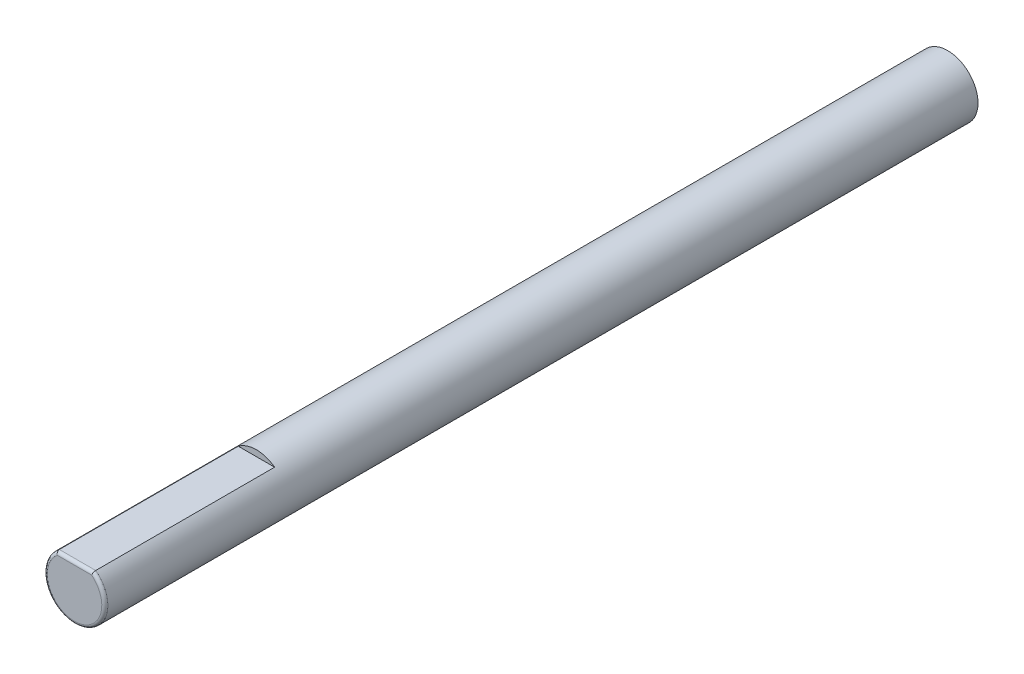
ISO-10303-21;
HEADER;
FILE_DESCRIPTION(('STEP AP214'),'2;1');
FILE_NAME('part.step','',(''),(''),'','','');
FILE_SCHEMA(('AUTOMOTIVE_DESIGN { 1 0 10303 214 1 1 1 1 }'));
ENDSEC;
DATA;
#1=APPLICATION_CONTEXT('core data for automotive mechanical design processes');
#2=APPLICATION_PROTOCOL_DEFINITION('international standard','automotive_design',2000,#1);
#3=PRODUCT_CONTEXT('',#1,'mechanical');
#4=PRODUCT('Part','Part','',(#3));
#5=PRODUCT_RELATED_PRODUCT_CATEGORY('part','',(#4));
#6=PRODUCT_DEFINITION_FORMATION('','',#4);
#7=PRODUCT_DEFINITION_CONTEXT('part definition',#1,'design');
#8=PRODUCT_DEFINITION('design','',#6,#7);
#9=PRODUCT_DEFINITION_SHAPE('','',#8);
#10=(LENGTH_UNIT() NAMED_UNIT(*) SI_UNIT(.MILLI.,.METRE.));
#11=(NAMED_UNIT(*) PLANE_ANGLE_UNIT() SI_UNIT($,.RADIAN.));
#12=(NAMED_UNIT(*) SI_UNIT($,.STERADIAN.) SOLID_ANGLE_UNIT());
#13=UNCERTAINTY_MEASURE_WITH_UNIT(LENGTH_MEASURE(1.E-05),#10,'distance_accuracy_value','');
#14=(GEOMETRIC_REPRESENTATION_CONTEXT(3) GLOBAL_UNCERTAINTY_ASSIGNED_CONTEXT((#13)) GLOBAL_UNIT_ASSIGNED_CONTEXT((#10,
#11,#12)) REPRESENTATION_CONTEXT('',''));
#15=CARTESIAN_POINT('',(0.,0.,0.));
#16=DIRECTION('',(0.,0.,1.));
#17=DIRECTION('',(1.,0.,0.));
#18=AXIS2_PLACEMENT_3D('',#15,#16,#17);
#19=CARTESIAN_POINT('',(0.,0.,36.));
#20=DIRECTION('',(0.,0.,-1.));
#21=DIRECTION('',(-1.,0.,0.));
#22=AXIS2_PLACEMENT_3D('',#19,#20,#21);
#23=CYLINDRICAL_SURFACE('',#22,2.5);
#24=DIRECTION('',(0.,0.,1.));
#25=VECTOR('',#24,1.);
#26=CARTESIAN_POINT('',(1.5,2.,21.));
#27=LINE('',#26,#25);
#28=CARTESIAN_POINT('',(1.5,2.,21.));
#29=VERTEX_POINT('',#28);
#30=CARTESIAN_POINT('',(1.5,2.,35.75));
#31=VERTEX_POINT('',#30);
#32=EDGE_CURVE('E83',#29,#31,#27,.T.);
#33=ORIENTED_EDGE('',*,*,#32,.T.);
#34=CARTESIAN_POINT('',(0.,0.,35.75));
#35=DIRECTION('',(0.,0.,1.));
#36=DIRECTION('',(1.,0.,0.));
#37=AXIS2_PLACEMENT_3D('',#34,#35,#36);
#38=CIRCLE('',#37,2.5);
#39=CARTESIAN_POINT('',(-1.5,2.,35.75));
#40=VERTEX_POINT('',#39);
#41=EDGE_CURVE('E47',#31,#40,#38,.F.);
#42=ORIENTED_EDGE('',*,*,#41,.T.);
#43=DIRECTION('',(0.,0.,1.));
#44=VECTOR('',#43,1.);
#45=CARTESIAN_POINT('',(-1.5,2.,21.));
#46=LINE('',#45,#44);
#47=CARTESIAN_POINT('',(-1.5,2.,21.));
#48=VERTEX_POINT('',#47);
#49=EDGE_CURVE('E82',#48,#40,#46,.T.);
#50=ORIENTED_EDGE('',*,*,#49,.F.);
#51=CARTESIAN_POINT('',(0.,0.,21.));
#52=DIRECTION('',(0.,0.,1.));
#53=DIRECTION('',(1.,0.,0.));
#54=AXIS2_PLACEMENT_3D('',#51,#52,#53);
#55=CIRCLE('',#54,2.5);
#56=EDGE_CURVE('E74',#29,#48,#55,.T.);
#57=ORIENTED_EDGE('',*,*,#56,.F.);
#58=EDGE_LOOP('',(#33,#42,#50,#57));
#59=FACE_BOUND('',#58,.T.);
#60=CARTESIAN_POINT('',(0.,0.,-36.));
#61=DIRECTION('',(0.,0.,1.));
#62=DIRECTION('',(1.,0.,0.));
#63=AXIS2_PLACEMENT_3D('',#60,#61,#62);
#64=CIRCLE('',#63,2.5);
#65=CARTESIAN_POINT('',(2.5,0.,-36.));
#66=VERTEX_POINT('',#65);
#67=EDGE_CURVE('E88',#66,#66,#64,.T.);
#68=ORIENTED_EDGE('',*,*,#67,.T.);
#69=EDGE_LOOP('',(#68));
#70=FACE_BOUND('',#69,.T.);
#71=ADVANCED_FACE('F33',(#59,#70),#23,.T.);
#72=CARTESIAN_POINT('',(0.,0.,36.));
#73=DIRECTION('',(0.,0.,1.));
#74=DIRECTION('',(1.,0.,0.));
#75=AXIS2_PLACEMENT_3D('',#72,#73,#74);
#76=PLANE('',#75);
#77=DIRECTION('',(1.,0.,0.));
#78=VECTOR('',#77,1.);
#79=CARTESIAN_POINT('',(-1.5,1.75,36.));
#80=LINE('',#79,#78);
#81=CARTESIAN_POINT('',(1.41421356237331,1.75,36.));
#82=VERTEX_POINT('',#81);
#83=CARTESIAN_POINT('',(-1.41421356237331,1.75,36.));
#84=VERTEX_POINT('',#83);
#85=EDGE_CURVE('E93',#82,#84,#80,.F.);
#86=ORIENTED_EDGE('',*,*,#85,.T.);
#87=CARTESIAN_POINT('',(0.,0.,36.));
#88=DIRECTION('',(0.,0.,1.));
#89=DIRECTION('',(1.,0.,0.));
#90=AXIS2_PLACEMENT_3D('',#87,#88,#89);
#91=CIRCLE('',#90,2.25);
#92=EDGE_CURVE('E95',#84,#82,#91,.T.);
#93=ORIENTED_EDGE('',*,*,#92,.T.);
#94=EDGE_LOOP('',(#86,#93));
#95=FACE_BOUND('',#94,.T.);
#96=ADVANCED_FACE('F110',(#95),#76,.T.);
#97=CARTESIAN_POINT('',(0.,0.,-36.));
#98=DIRECTION('',(0.,0.,1.));
#99=DIRECTION('',(1.,0.,0.));
#100=AXIS2_PLACEMENT_3D('',#97,#98,#99);
#101=PLANE('',#100);
#102=ORIENTED_EDGE('',*,*,#67,.F.);
#103=EDGE_LOOP('',(#102));
#104=FACE_BOUND('',#103,.T.);
#105=ADVANCED_FACE('F111',(#104),#101,.F.);
#106=CARTESIAN_POINT('',(-1.5,2.,21.));
#107=DIRECTION('',(0.,-1.,0.));
#108=DIRECTION('',(0.,0.,-1.));
#109=AXIS2_PLACEMENT_3D('',#106,#107,#108);
#110=PLANE('',#109);
#111=ORIENTED_EDGE('',*,*,#49,.T.);
#112=DIRECTION('',(1.,0.,0.));
#113=VECTOR('',#112,1.);
#114=CARTESIAN_POINT('',(1.5,2.,35.75));
#115=LINE('',#114,#113);
#116=EDGE_CURVE('E11',#40,#31,#115,.T.);
#117=ORIENTED_EDGE('',*,*,#116,.T.);
#118=ORIENTED_EDGE('',*,*,#32,.F.);
#119=DIRECTION('',(1.,0.,0.));
#120=VECTOR('',#119,1.);
#121=CARTESIAN_POINT('',(-1.5,2.,21.));
#122=LINE('',#121,#120);
#123=EDGE_CURVE('E77',#48,#29,#122,.T.);
#124=ORIENTED_EDGE('',*,*,#123,.F.);
#125=EDGE_LOOP('',(#111,#117,#118,#124));
#126=FACE_BOUND('',#125,.T.);
#127=ADVANCED_FACE('F81',(#126),#110,.F.);
#128=CARTESIAN_POINT('',(0.,0.,21.));
#129=DIRECTION('',(0.,0.,1.));
#130=DIRECTION('',(1.,0.,0.));
#131=AXIS2_PLACEMENT_3D('',#128,#129,#130);
#132=PLANE('',#131);
#133=ORIENTED_EDGE('',*,*,#56,.T.);
#134=ORIENTED_EDGE('',*,*,#123,.T.);
#135=EDGE_LOOP('',(#133,#134));
#136=FACE_BOUND('',#135,.T.);
#137=ADVANCED_FACE('F76',(#136),#132,.T.);
#138=CARTESIAN_POINT('',(-1.5,1.75,35.75));
#139=DIRECTION('',(-1.,0.,0.));
#140=DIRECTION('',(0.,0.,1.));
#141=AXIS2_PLACEMENT_3D('',#138,#139,#140);
#142=CYLINDRICAL_SURFACE('',#141,0.25);
#143=CARTESIAN_POINT('',(1.5,2.,35.75));
#144=CARTESIAN_POINT('',(1.50000417865665,2.00001412295188,35.7635362476095));
#145=CARTESIAN_POINT('',(1.49963384944121,1.99890156739159,35.7770649136864));
#146=CARTESIAN_POINT('',(1.49817646893611,1.99453178409593,35.803703499777));
#147=CARTESIAN_POINT('',(1.49709092730071,1.99127907377054,35.8168142409595));
#148=CARTESIAN_POINT('',(1.49423517680934,1.98273685679408,35.8422734630497));
#149=CARTESIAN_POINT('',(1.4924649704674,1.9774473576219,35.8546219467561));
#150=CARTESIAN_POINT('',(1.48829599124956,1.9650205975245,35.8782344653412));
#151=CARTESIAN_POINT('',(1.4858971171193,1.95788303894975,35.8894983251284));
#152=CARTESIAN_POINT('',(1.48048407646806,1.94182565292694,35.9108898233462));
#153=CARTESIAN_POINT('',(1.47745811354684,1.9328717380689,35.9209888424914));
#154=CARTESIAN_POINT('',(1.47090719118636,1.91355724701079,35.9395481990963));
#155=CARTESIAN_POINT('',(1.4673820594633,1.90319618519681,35.9480079683853));
#156=CARTESIAN_POINT('',(1.4597416584497,1.8808304290218,35.9634884539344));
#157=CARTESIAN_POINT('',(1.45560597515412,1.86877017347735,35.9704187042036));
#158=CARTESIAN_POINT('',(1.44699364632756,1.84377210784133,35.9821581165234));
#159=CARTESIAN_POINT('',(1.44251701551424,1.83083433563209,35.9869673700701));
#160=CARTESIAN_POINT('',(1.43429994960781,1.80720313950861,35.9936091690749));
#161=CARTESIAN_POINT('',(1.43060199205919,1.79660800814989,35.9958544493701));
#162=CARTESIAN_POINT('',(1.42312126586469,1.7752602081721,35.9989535542845));
#163=CARTESIAN_POINT('',(1.41933866039702,1.76450785453121,35.9998098556094));
#164=CARTESIAN_POINT('',(1.41509974133087,1.75250707809193,35.9999905927916));
#165=CARTESIAN_POINT('',(1.41465671804431,1.75125342894238,36.0000000237643));
#166=CARTESIAN_POINT('',(1.4142135623731,1.75,36.));
#167=B_SPLINE_CURVE_WITH_KNOTS('',3,(#143,#144,#145,#146,#147,#148,#149,#150,#151,#152,#153,
#154,#155,#156,#157,#158,#159,#160,#161,#162,#163,#164,#165,#166),.UNSPECIFIED.,.F.,.F.,(4,2,2,
2,2,2,2,2,2,2,2,4),(0.,0.0405464298652532,0.0810075482566391,0.121468518080043,0.16193600862905,
0.203248063107221,0.244574410996504,0.287919195499839,0.331262110001295,0.365515938591456,
0.39970862134593,0.403697443625867),.UNSPECIFIED.);
#168=EDGE_CURVE('E98',#31,#82,#167,.T.);
#169=ORIENTED_EDGE('',*,*,#168,.F.);
#170=ORIENTED_EDGE('',*,*,#116,.F.);
#171=CARTESIAN_POINT('',(-1.5,2.,35.75));
#172=CARTESIAN_POINT('',(-1.50000417865665,2.00001412295188,35.7635362476095));
#173=CARTESIAN_POINT('',(-1.49963384944121,1.99890156739159,35.7770649136864));
#174=CARTESIAN_POINT('',(-1.49817646893611,1.99453178409593,35.803703499777));
#175=CARTESIAN_POINT('',(-1.49709092730071,1.99127907377054,35.8168142409595));
#176=CARTESIAN_POINT('',(-1.49423517680934,1.98273685679408,35.8422734630497));
#177=CARTESIAN_POINT('',(-1.4924649704674,1.9774473576219,35.8546219467561));
#178=CARTESIAN_POINT('',(-1.48829599124956,1.9650205975245,35.8782344653412));
#179=CARTESIAN_POINT('',(-1.4858971171193,1.95788303894975,35.8894983251284));
#180=CARTESIAN_POINT('',(-1.48048407646806,1.94182565292694,35.9108898233462));
#181=CARTESIAN_POINT('',(-1.47745811354684,1.9328717380689,35.9209888424914));
#182=CARTESIAN_POINT('',(-1.47090719118636,1.91355724701079,35.9395481990963));
#183=CARTESIAN_POINT('',(-1.4673820594633,1.90319618519681,35.9480079683853));
#184=CARTESIAN_POINT('',(-1.4597416584497,1.8808304290218,35.9634884539344));
#185=CARTESIAN_POINT('',(-1.45560597515412,1.86877017347735,35.9704187042036));
#186=CARTESIAN_POINT('',(-1.44699364632756,1.84377210784133,35.9821581165234));
#187=CARTESIAN_POINT('',(-1.44251701551424,1.83083433563209,35.9869673700701));
#188=CARTESIAN_POINT('',(-1.43429994960781,1.80720313950861,35.9936091690749));
#189=CARTESIAN_POINT('',(-1.43060199205919,1.79660800814989,35.9958544493701));
#190=CARTESIAN_POINT('',(-1.42312126586469,1.7752602081721,35.9989535542845));
#191=CARTESIAN_POINT('',(-1.41933866039702,1.76450785453121,35.9998098556094));
#192=CARTESIAN_POINT('',(-1.41509974133087,1.75250707809193,35.9999905927916));
#193=CARTESIAN_POINT('',(-1.41465671804431,1.75125342894238,36.0000000237643));
#194=CARTESIAN_POINT('',(-1.4142135623731,1.75,36.));
#195=B_SPLINE_CURVE_WITH_KNOTS('',3,(#171,#172,#173,#174,#175,#176,#177,#178,#179,#180,#181,
#182,#183,#184,#185,#186,#187,#188,#189,#190,#191,#192,#193,#194),.UNSPECIFIED.,.F.,.F.,(4,2,2,
2,2,2,2,2,2,2,2,4),(0.,0.0405464298652532,0.0810075482566391,0.121468518080043,0.16193600862905,
0.203248063107221,0.244574410996504,0.287919195499839,0.331262110001295,0.365515938591456,
0.39970862134593,0.403697443625867),.UNSPECIFIED.);
#196=EDGE_CURVE('E38',#84,#40,#195,.F.);
#197=ORIENTED_EDGE('',*,*,#196,.F.);
#198=ORIENTED_EDGE('',*,*,#85,.F.);
#199=EDGE_LOOP('',(#169,#170,#197,#198));
#200=FACE_BOUND('',#199,.T.);
#201=ADVANCED_FACE('F35',(#200),#142,.T.);
#202=CARTESIAN_POINT('',(0.,0.,35.75));
#203=DIRECTION('',(0.,0.,1.));
#204=DIRECTION('',(1.,0.,0.));
#205=AXIS2_PLACEMENT_3D('',#202,#203,#204);
#206=TOROIDAL_SURFACE('',#205,2.25,0.25);
#207=ORIENTED_EDGE('',*,*,#196,.T.);
#208=ORIENTED_EDGE('',*,*,#41,.F.);
#209=ORIENTED_EDGE('',*,*,#168,.T.);
#210=ORIENTED_EDGE('',*,*,#92,.F.);
#211=EDGE_LOOP('',(#207,#208,#209,#210));
#212=FACE_BOUND('',#211,.T.);
#213=ADVANCED_FACE('F103',(#212),#206,.T.);
#214=CLOSED_SHELL('',(#71,#96,#105,#127,#137,#201,#213));
#215=MANIFOLD_SOLID_BREP('B2',#214);
#216=ADVANCED_BREP_SHAPE_REPRESENTATION('',(#18,#215),#14);
#217=SHAPE_DEFINITION_REPRESENTATION(#9,#216);
ENDSEC;
END-ISO-10303-21;
